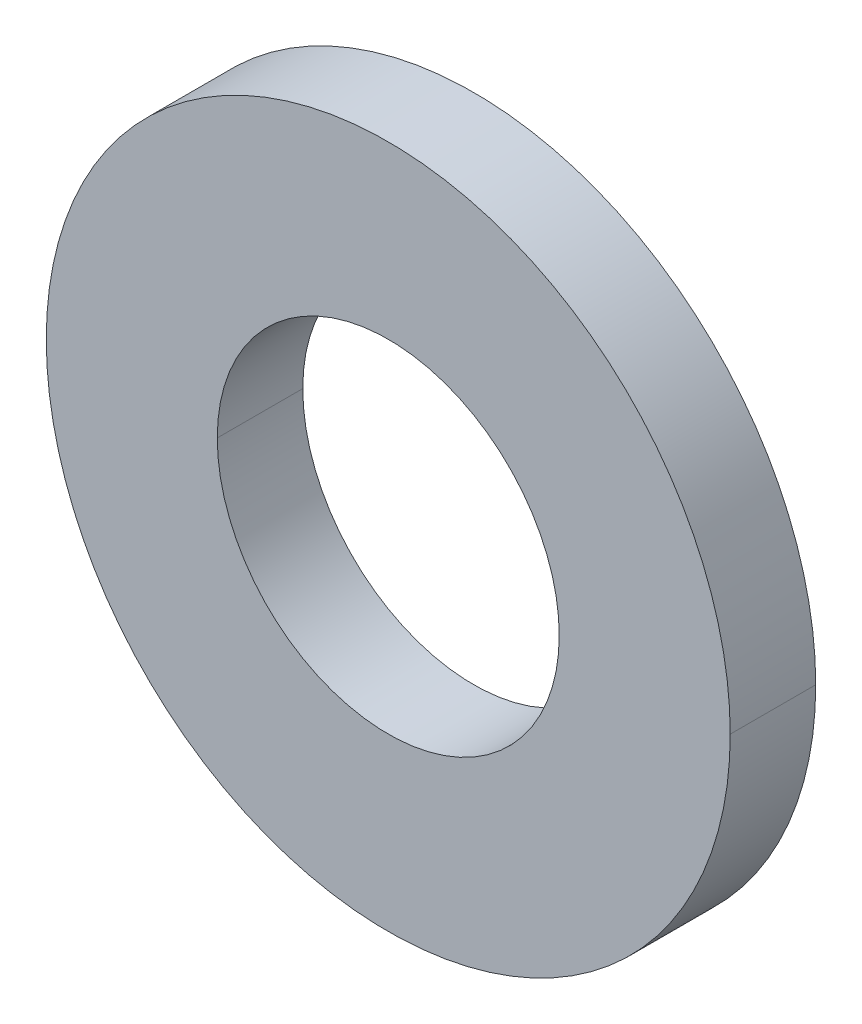
ISO-10303-21;
HEADER;
FILE_DESCRIPTION(('STEP AP214'),'2;1');
FILE_NAME('part.step','',(''),(''),'','','');
FILE_SCHEMA(('AUTOMOTIVE_DESIGN { 1 0 10303 214 1 1 1 1 }'));
ENDSEC;
DATA;
#1=APPLICATION_CONTEXT('core data for automotive mechanical design processes');
#2=APPLICATION_PROTOCOL_DEFINITION('international standard','automotive_design',2000,#1);
#3=PRODUCT_CONTEXT('',#1,'mechanical');
#4=PRODUCT('Part','Part','',(#3));
#5=PRODUCT_RELATED_PRODUCT_CATEGORY('part','',(#4));
#6=PRODUCT_DEFINITION_FORMATION('','',#4);
#7=PRODUCT_DEFINITION_CONTEXT('part definition',#1,'design');
#8=PRODUCT_DEFINITION('design','',#6,#7);
#9=PRODUCT_DEFINITION_SHAPE('','',#8);
#10=(LENGTH_UNIT() NAMED_UNIT(*) SI_UNIT(.MILLI.,.METRE.));
#11=(NAMED_UNIT(*) PLANE_ANGLE_UNIT() SI_UNIT($,.RADIAN.));
#12=(NAMED_UNIT(*) SI_UNIT($,.STERADIAN.) SOLID_ANGLE_UNIT());
#13=UNCERTAINTY_MEASURE_WITH_UNIT(LENGTH_MEASURE(1.E-05),#10,'distance_accuracy_value','');
#14=(GEOMETRIC_REPRESENTATION_CONTEXT(3) GLOBAL_UNCERTAINTY_ASSIGNED_CONTEXT((#13)) GLOBAL_UNIT_ASSIGNED_CONTEXT((#10,
#11,#12)) REPRESENTATION_CONTEXT('',''));
#15=CARTESIAN_POINT('',(0.,0.,0.));
#16=DIRECTION('',(0.,0.,1.));
#17=DIRECTION('',(1.,0.,0.));
#18=AXIS2_PLACEMENT_3D('',#15,#16,#17);
#19=CARTESIAN_POINT('',(0.,0.,1.));
#20=DIRECTION('',(0.,0.,-1.));
#21=DIRECTION('',(-1.,0.,0.));
#22=AXIS2_PLACEMENT_3D('',#19,#20,#21);
#23=CYLINDRICAL_SURFACE('',#22,2.);
#24=DIRECTION('',(0.,0.,-1.));
#25=VECTOR('',#24,1.);
#26=CARTESIAN_POINT('',(2.,0.,1.));
#27=LINE('',#26,#25);
#28=CARTESIAN_POINT('',(2.,0.,1.));
#29=VERTEX_POINT('',#28);
#30=CARTESIAN_POINT('',(2.,0.,0.));
#31=VERTEX_POINT('',#30);
#32=EDGE_CURVE('E87',#29,#31,#27,.T.);
#33=ORIENTED_EDGE('',*,*,#32,.F.);
#34=CARTESIAN_POINT('',(0.,0.,1.));
#35=DIRECTION('',(0.,0.,1.));
#36=DIRECTION('',(1.,0.,0.));
#37=AXIS2_PLACEMENT_3D('',#34,#35,#36);
#38=CIRCLE('',#37,2.);
#39=CARTESIAN_POINT('',(-2.,0.,1.));
#40=VERTEX_POINT('',#39);
#41=EDGE_CURVE('E79',#29,#40,#38,.T.);
#42=ORIENTED_EDGE('',*,*,#41,.T.);
#43=DIRECTION('',(0.,0.,-1.));
#44=VECTOR('',#43,1.);
#45=CARTESIAN_POINT('',(-2.,0.,1.));
#46=LINE('',#45,#44);
#47=CARTESIAN_POINT('',(-2.,0.,0.));
#48=VERTEX_POINT('',#47);
#49=EDGE_CURVE('E77',#40,#48,#46,.T.);
#50=ORIENTED_EDGE('',*,*,#49,.T.);
#51=CARTESIAN_POINT('',(0.,0.,0.));
#52=DIRECTION('',(0.,0.,1.));
#53=DIRECTION('',(1.,0.,0.));
#54=AXIS2_PLACEMENT_3D('',#51,#52,#53);
#55=CIRCLE('',#54,2.);
#56=EDGE_CURVE('E10',#31,#48,#55,.T.);
#57=ORIENTED_EDGE('',*,*,#56,.F.);
#58=EDGE_LOOP('',(#33,#42,#50,#57));
#59=FACE_BOUND('',#58,.T.);
#60=ADVANCED_FACE('F15',(#59),#23,.F.);
#61=CARTESIAN_POINT('',(0.,0.,1.));
#62=DIRECTION('',(0.,0.,-1.));
#63=DIRECTION('',(-1.,0.,0.));
#64=AXIS2_PLACEMENT_3D('',#61,#62,#63);
#65=CYLINDRICAL_SURFACE('',#64,4.);
#66=DIRECTION('',(0.,0.,-1.));
#67=VECTOR('',#66,1.);
#68=CARTESIAN_POINT('',(4.,0.,1.));
#69=LINE('',#68,#67);
#70=CARTESIAN_POINT('',(4.,0.,1.));
#71=VERTEX_POINT('',#70);
#72=CARTESIAN_POINT('',(4.,0.,0.));
#73=VERTEX_POINT('',#72);
#74=EDGE_CURVE('E18',#71,#73,#69,.T.);
#75=ORIENTED_EDGE('',*,*,#74,.F.);
#76=CARTESIAN_POINT('',(0.,0.,1.));
#77=DIRECTION('',(0.,0.,1.));
#78=DIRECTION('',(1.,0.,0.));
#79=AXIS2_PLACEMENT_3D('',#76,#77,#78);
#80=CIRCLE('',#79,4.);
#81=CARTESIAN_POINT('',(-4.,0.,1.));
#82=VERTEX_POINT('',#81);
#83=EDGE_CURVE('E62',#82,#71,#80,.T.);
#84=ORIENTED_EDGE('',*,*,#83,.F.);
#85=DIRECTION('',(0.,0.,-1.));
#86=VECTOR('',#85,1.);
#87=CARTESIAN_POINT('',(-4.,0.,1.));
#88=LINE('',#87,#86);
#89=CARTESIAN_POINT('',(-4.,0.,0.));
#90=VERTEX_POINT('',#89);
#91=EDGE_CURVE('E99',#82,#90,#88,.T.);
#92=ORIENTED_EDGE('',*,*,#91,.T.);
#93=CARTESIAN_POINT('',(0.,0.,0.));
#94=DIRECTION('',(0.,0.,1.));
#95=DIRECTION('',(1.,0.,0.));
#96=AXIS2_PLACEMENT_3D('',#93,#94,#95);
#97=CIRCLE('',#96,4.);
#98=EDGE_CURVE('E25',#90,#73,#97,.T.);
#99=ORIENTED_EDGE('',*,*,#98,.T.);
#100=EDGE_LOOP('',(#75,#84,#92,#99));
#101=FACE_BOUND('',#100,.T.);
#102=ADVANCED_FACE('F133',(#101),#65,.T.);
#103=CARTESIAN_POINT('',(0.,0.,0.));
#104=DIRECTION('',(0.,0.,1.));
#105=DIRECTION('',(1.,0.,0.));
#106=AXIS2_PLACEMENT_3D('',#103,#104,#105);
#107=PLANE('',#106);
#108=CARTESIAN_POINT('',(0.,0.,0.));
#109=DIRECTION('',(0.,0.,1.));
#110=DIRECTION('',(1.,0.,0.));
#111=AXIS2_PLACEMENT_3D('',#108,#109,#110);
#112=CIRCLE('',#111,2.);
#113=EDGE_CURVE('E72',#48,#31,#112,.T.);
#114=ORIENTED_EDGE('',*,*,#113,.T.);
#115=ORIENTED_EDGE('',*,*,#56,.T.);
#116=EDGE_LOOP('',(#114,#115));
#117=FACE_BOUND('',#116,.T.);
#118=ORIENTED_EDGE('',*,*,#98,.F.);
#119=CARTESIAN_POINT('',(0.,0.,0.));
#120=DIRECTION('',(0.,0.,1.));
#121=DIRECTION('',(1.,0.,0.));
#122=AXIS2_PLACEMENT_3D('',#119,#120,#121);
#123=CIRCLE('',#122,4.);
#124=EDGE_CURVE('E100',#73,#90,#123,.T.);
#125=ORIENTED_EDGE('',*,*,#124,.F.);
#126=EDGE_LOOP('',(#118,#125));
#127=FACE_BOUND('',#126,.T.);
#128=ADVANCED_FACE('F70',(#117,#127),#107,.F.);
#129=CARTESIAN_POINT('',(0.,0.,1.));
#130=DIRECTION('',(0.,0.,1.));
#131=DIRECTION('',(1.,0.,0.));
#132=AXIS2_PLACEMENT_3D('',#129,#130,#131);
#133=PLANE('',#132);
#134=CARTESIAN_POINT('',(0.,0.,1.));
#135=DIRECTION('',(0.,0.,1.));
#136=DIRECTION('',(1.,0.,0.));
#137=AXIS2_PLACEMENT_3D('',#134,#135,#136);
#138=CIRCLE('',#137,2.);
#139=EDGE_CURVE('E95',#40,#29,#138,.T.);
#140=ORIENTED_EDGE('',*,*,#139,.F.);
#141=ORIENTED_EDGE('',*,*,#41,.F.);
#142=EDGE_LOOP('',(#140,#141));
#143=FACE_BOUND('',#142,.T.);
#144=ORIENTED_EDGE('',*,*,#83,.T.);
#145=CARTESIAN_POINT('',(0.,0.,1.));
#146=DIRECTION('',(0.,0.,1.));
#147=DIRECTION('',(1.,0.,0.));
#148=AXIS2_PLACEMENT_3D('',#145,#146,#147);
#149=CIRCLE('',#148,4.);
#150=EDGE_CURVE('E84',#71,#82,#149,.T.);
#151=ORIENTED_EDGE('',*,*,#150,.T.);
#152=EDGE_LOOP('',(#144,#151));
#153=FACE_BOUND('',#152,.T.);
#154=ADVANCED_FACE('F122',(#143,#153),#133,.T.);
#155=CARTESIAN_POINT('',(0.,0.,1.));
#156=DIRECTION('',(0.,0.,-1.));
#157=DIRECTION('',(-1.,0.,0.));
#158=AXIS2_PLACEMENT_3D('',#155,#156,#157);
#159=CYLINDRICAL_SURFACE('',#158,4.);
#160=ORIENTED_EDGE('',*,*,#150,.F.);
#161=ORIENTED_EDGE('',*,*,#74,.T.);
#162=ORIENTED_EDGE('',*,*,#124,.T.);
#163=ORIENTED_EDGE('',*,*,#91,.F.);
#164=EDGE_LOOP('',(#160,#161,#162,#163));
#165=FACE_BOUND('',#164,.T.);
#166=ADVANCED_FACE('F124',(#165),#159,.T.);
#167=CARTESIAN_POINT('',(0.,0.,1.));
#168=DIRECTION('',(0.,0.,-1.));
#169=DIRECTION('',(-1.,0.,0.));
#170=AXIS2_PLACEMENT_3D('',#167,#168,#169);
#171=CYLINDRICAL_SURFACE('',#170,2.);
#172=ORIENTED_EDGE('',*,*,#139,.T.);
#173=ORIENTED_EDGE('',*,*,#32,.T.);
#174=ORIENTED_EDGE('',*,*,#113,.F.);
#175=ORIENTED_EDGE('',*,*,#49,.F.);
#176=EDGE_LOOP('',(#172,#173,#174,#175));
#177=FACE_BOUND('',#176,.T.);
#178=ADVANCED_FACE('F86',(#177),#171,.F.);
#179=CLOSED_SHELL('',(#60,#102,#128,#154,#166,#178));
#180=MANIFOLD_SOLID_BREP('B1',#179);
#181=ADVANCED_BREP_SHAPE_REPRESENTATION('',(#18,#180),#14);
#182=SHAPE_DEFINITION_REPRESENTATION(#9,#181);
ENDSEC;
END-ISO-10303-21;
